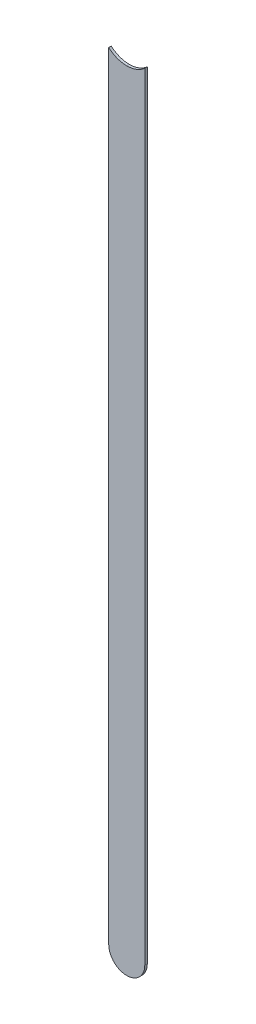
ISO-10303-21;
HEADER;
FILE_DESCRIPTION(('STEP AP214'),'2;1');
FILE_NAME('part.step','',(''),(''),'','','');
FILE_SCHEMA(('AUTOMOTIVE_DESIGN { 1 0 10303 214 1 1 1 1 }'));
ENDSEC;
DATA;
#1=APPLICATION_CONTEXT('core data for automotive mechanical design processes');
#2=APPLICATION_PROTOCOL_DEFINITION('international standard','automotive_design',2000,#1);
#3=PRODUCT_CONTEXT('',#1,'mechanical');
#4=PRODUCT('Part','Part','',(#3));
#5=PRODUCT_RELATED_PRODUCT_CATEGORY('part','',(#4));
#6=PRODUCT_DEFINITION_FORMATION('','',#4);
#7=PRODUCT_DEFINITION_CONTEXT('part definition',#1,'design');
#8=PRODUCT_DEFINITION('design','',#6,#7);
#9=PRODUCT_DEFINITION_SHAPE('','',#8);
#10=(LENGTH_UNIT() NAMED_UNIT(*) SI_UNIT(.MILLI.,.METRE.));
#11=(NAMED_UNIT(*) PLANE_ANGLE_UNIT() SI_UNIT($,.RADIAN.));
#12=(NAMED_UNIT(*) SI_UNIT($,.STERADIAN.) SOLID_ANGLE_UNIT());
#13=UNCERTAINTY_MEASURE_WITH_UNIT(LENGTH_MEASURE(1.E-05),#10,'distance_accuracy_value','');
#14=(GEOMETRIC_REPRESENTATION_CONTEXT(3) GLOBAL_UNCERTAINTY_ASSIGNED_CONTEXT((#13)) GLOBAL_UNIT_ASSIGNED_CONTEXT((#10,
#11,#12)) REPRESENTATION_CONTEXT('',''));
#15=CARTESIAN_POINT('',(0.,0.,0.));
#16=DIRECTION('',(0.,0.,1.));
#17=DIRECTION('',(1.,0.,0.));
#18=AXIS2_PLACEMENT_3D('',#15,#16,#17);
#19=CARTESIAN_POINT('',(173.478,-123.825,-0.035));
#20=DIRECTION('',(-1.,0.,0.));
#21=DIRECTION('',(0.,0.,1.));
#22=AXIS2_PLACEMENT_3D('',#19,#20,#21);
#23=PLANE('',#22);
#24=DIRECTION('',(0.,0.,-1.));
#25=VECTOR('',#24,1.);
#26=CARTESIAN_POINT('',(173.478,-113.0555084971,-0.045));
#27=LINE('',#26,#25);
#28=CARTESIAN_POINT('',(173.478,-113.0555084971,0.));
#29=VERTEX_POINT('',#28);
#30=CARTESIAN_POINT('',(173.478,-113.0555084971,-0.035));
#31=VERTEX_POINT('',#30);
#32=EDGE_CURVE('E11',#29,#31,#27,.T.);
#33=ORIENTED_EDGE('',*,*,#32,.F.);
#34=DIRECTION('',(0.,1.,0.));
#35=VECTOR('',#34,1.);
#36=CARTESIAN_POINT('',(173.478,-123.825,0.));
#37=LINE('',#36,#35);
#38=CARTESIAN_POINT('',(173.478,-123.825,0.));
#39=VERTEX_POINT('',#38);
#40=EDGE_CURVE('E74',#39,#29,#37,.T.);
#41=ORIENTED_EDGE('',*,*,#40,.F.);
#42=DIRECTION('',(0.,0.,1.));
#43=VECTOR('',#42,1.);
#44=CARTESIAN_POINT('',(173.478,-123.825,-0.035));
#45=LINE('',#44,#43);
#46=CARTESIAN_POINT('',(173.478,-123.825,-0.035));
#47=VERTEX_POINT('',#46);
#48=EDGE_CURVE('E68',#47,#39,#45,.T.);
#49=ORIENTED_EDGE('',*,*,#48,.F.);
#50=DIRECTION('',(0.,1.,0.));
#51=VECTOR('',#50,1.);
#52=CARTESIAN_POINT('',(173.478,-123.825,-0.035));
#53=LINE('',#52,#51);
#54=EDGE_CURVE('E71',#47,#31,#53,.T.);
#55=ORIENTED_EDGE('',*,*,#54,.T.);
#56=EDGE_LOOP('',(#33,#41,#49,#55));
#57=FACE_BOUND('',#56,.T.);
#58=ADVANCED_FACE('F17',(#57),#23,.F.);
#59=CARTESIAN_POINT('',(173.228,-112.776,-0.045));
#60=DIRECTION('',(0.,0.,-1.));
#61=DIRECTION('',(0.,-1.,0.));
#62=AXIS2_PLACEMENT_3D('',#59,#60,#61);
#63=CYLINDRICAL_SURFACE('',#62,0.375);
#64=CARTESIAN_POINT('',(173.228,-112.776,-0.035));
#65=DIRECTION('',(0.,0.,-1.));
#66=DIRECTION('',(0.,-1.,0.));
#67=AXIS2_PLACEMENT_3D('',#64,#65,#66);
#68=CIRCLE('',#67,0.375);
#69=CARTESIAN_POINT('',(173.228,-113.151,-0.035));
#70=VERTEX_POINT('',#69);
#71=EDGE_CURVE('E96',#31,#70,#68,.T.);
#72=ORIENTED_EDGE('',*,*,#71,.T.);
#73=DIRECTION('',(0.,0.,1.));
#74=VECTOR('',#73,1.);
#75=CARTESIAN_POINT('',(173.228,-113.151,-0.045));
#76=LINE('',#75,#74);
#77=CARTESIAN_POINT('',(173.228,-113.151,0.));
#78=VERTEX_POINT('',#77);
#79=EDGE_CURVE('E27',#70,#78,#76,.T.);
#80=ORIENTED_EDGE('',*,*,#79,.T.);
#81=CARTESIAN_POINT('',(173.228,-112.776,0.));
#82=DIRECTION('',(0.,0.,-1.));
#83=DIRECTION('',(0.,-1.,0.));
#84=AXIS2_PLACEMENT_3D('',#81,#82,#83);
#85=CIRCLE('',#84,0.375);
#86=EDGE_CURVE('E21',#29,#78,#85,.T.);
#87=ORIENTED_EDGE('',*,*,#86,.F.);
#88=ORIENTED_EDGE('',*,*,#32,.T.);
#89=EDGE_LOOP('',(#72,#80,#87,#88));
#90=FACE_BOUND('',#89,.T.);
#91=ADVANCED_FACE('F19',(#90),#63,.F.);
#92=CARTESIAN_POINT('',(173.228,-112.776,-0.045));
#93=DIRECTION('',(0.,0.,-1.));
#94=DIRECTION('',(0.,-1.,0.));
#95=AXIS2_PLACEMENT_3D('',#92,#93,#94);
#96=CYLINDRICAL_SURFACE('',#95,0.375);
#97=ORIENTED_EDGE('',*,*,#79,.F.);
#98=CARTESIAN_POINT('',(173.228,-112.776,-0.035));
#99=DIRECTION('',(0.,0.,-1.));
#100=DIRECTION('',(0.,-1.,0.));
#101=AXIS2_PLACEMENT_3D('',#98,#99,#100);
#102=CIRCLE('',#101,0.375);
#103=CARTESIAN_POINT('',(172.978,-113.0555084972,-0.035));
#104=VERTEX_POINT('',#103);
#105=EDGE_CURVE('E80',#70,#104,#102,.T.);
#106=ORIENTED_EDGE('',*,*,#105,.T.);
#107=DIRECTION('',(0.,0.,-1.));
#108=VECTOR('',#107,1.);
#109=CARTESIAN_POINT('',(172.978,-113.0555084971,-0.045));
#110=LINE('',#109,#108);
#111=CARTESIAN_POINT('',(172.978,-113.0555084972,0.));
#112=VERTEX_POINT('',#111);
#113=EDGE_CURVE('E128',#112,#104,#110,.T.);
#114=ORIENTED_EDGE('',*,*,#113,.F.);
#115=CARTESIAN_POINT('',(173.228,-112.776,0.));
#116=DIRECTION('',(0.,0.,-1.));
#117=DIRECTION('',(0.,-1.,0.));
#118=AXIS2_PLACEMENT_3D('',#115,#116,#117);
#119=CIRCLE('',#118,0.375);
#120=EDGE_CURVE('E110',#78,#112,#119,.T.);
#121=ORIENTED_EDGE('',*,*,#120,.F.);
#122=EDGE_LOOP('',(#97,#106,#114,#121));
#123=FACE_BOUND('',#122,.T.);
#124=ADVANCED_FACE('F161',(#123),#96,.F.);
#125=CARTESIAN_POINT('',(172.978,-112.776,0.));
#126=DIRECTION('',(0.,0.,1.));
#127=DIRECTION('',(1.,0.,0.));
#128=AXIS2_PLACEMENT_3D('',#125,#126,#127);
#129=PLANE('',#128);
#130=ORIENTED_EDGE('',*,*,#120,.T.);
#131=DIRECTION('',(0.,-1.,0.));
#132=VECTOR('',#131,1.);
#133=CARTESIAN_POINT('',(172.978,-112.776,0.));
#134=LINE('',#133,#132);
#135=CARTESIAN_POINT('',(172.978,-123.825,0.));
#136=VERTEX_POINT('',#135);
#137=EDGE_CURVE('E136',#112,#136,#134,.T.);
#138=ORIENTED_EDGE('',*,*,#137,.T.);
#139=CARTESIAN_POINT('',(173.228,-123.825,0.));
#140=DIRECTION('',(0.,0.,1.));
#141=DIRECTION('',(-1.,0.,0.));
#142=AXIS2_PLACEMENT_3D('',#139,#140,#141);
#143=CIRCLE('',#142,0.25);
#144=EDGE_CURVE('E79',#136,#39,#143,.T.);
#145=ORIENTED_EDGE('',*,*,#144,.T.);
#146=ORIENTED_EDGE('',*,*,#40,.T.);
#147=ORIENTED_EDGE('',*,*,#86,.T.);
#148=EDGE_LOOP('',(#130,#138,#145,#146,#147));
#149=FACE_BOUND('',#148,.T.);
#150=ADVANCED_FACE('F169',(#149),#129,.T.);
#151=CARTESIAN_POINT('',(173.228,-123.825,-0.035));
#152=DIRECTION('',(0.,0.,-1.));
#153=DIRECTION('',(-1.,0.,0.));
#154=AXIS2_PLACEMENT_3D('',#151,#152,#153);
#155=CYLINDRICAL_SURFACE('',#154,0.25);
#156=CARTESIAN_POINT('',(173.228,-123.825,-0.035));
#157=DIRECTION('',(0.,0.,1.));
#158=DIRECTION('',(-1.,0.,0.));
#159=AXIS2_PLACEMENT_3D('',#156,#157,#158);
#160=CIRCLE('',#159,0.25);
#161=CARTESIAN_POINT('',(172.978,-123.825,-0.035));
#162=VERTEX_POINT('',#161);
#163=EDGE_CURVE('E84',#162,#47,#160,.T.);
#164=ORIENTED_EDGE('',*,*,#163,.T.);
#165=ORIENTED_EDGE('',*,*,#48,.T.);
#166=ORIENTED_EDGE('',*,*,#144,.F.);
#167=DIRECTION('',(0.,0.,1.));
#168=VECTOR('',#167,1.);
#169=CARTESIAN_POINT('',(172.978,-123.825,-0.035));
#170=LINE('',#169,#168);
#171=EDGE_CURVE('E88',#162,#136,#170,.T.);
#172=ORIENTED_EDGE('',*,*,#171,.F.);
#173=EDGE_LOOP('',(#164,#165,#166,#172));
#174=FACE_BOUND('',#173,.T.);
#175=ADVANCED_FACE('F85',(#174),#155,.T.);
#176=CARTESIAN_POINT('',(172.978,-112.776,-0.035));
#177=DIRECTION('',(0.,0.,1.));
#178=DIRECTION('',(1.,0.,0.));
#179=AXIS2_PLACEMENT_3D('',#176,#177,#178);
#180=PLANE('',#179);
#181=ORIENTED_EDGE('',*,*,#71,.F.);
#182=ORIENTED_EDGE('',*,*,#54,.F.);
#183=ORIENTED_EDGE('',*,*,#163,.F.);
#184=DIRECTION('',(0.,-1.,0.));
#185=VECTOR('',#184,1.);
#186=CARTESIAN_POINT('',(172.978,-112.776,-0.035));
#187=LINE('',#186,#185);
#188=EDGE_CURVE('E103',#104,#162,#187,.T.);
#189=ORIENTED_EDGE('',*,*,#188,.F.);
#190=ORIENTED_EDGE('',*,*,#105,.F.);
#191=EDGE_LOOP('',(#181,#182,#183,#189,#190));
#192=FACE_BOUND('',#191,.T.);
#193=ADVANCED_FACE('F94',(#192),#180,.F.);
#194=CARTESIAN_POINT('',(172.978,-112.776,-0.035));
#195=DIRECTION('',(1.,0.,0.));
#196=DIRECTION('',(0.,1.,0.));
#197=AXIS2_PLACEMENT_3D('',#194,#195,#196);
#198=PLANE('',#197);
#199=ORIENTED_EDGE('',*,*,#171,.T.);
#200=ORIENTED_EDGE('',*,*,#137,.F.);
#201=ORIENTED_EDGE('',*,*,#113,.T.);
#202=ORIENTED_EDGE('',*,*,#188,.T.);
#203=EDGE_LOOP('',(#199,#200,#201,#202));
#204=FACE_BOUND('',#203,.T.);
#205=ADVANCED_FACE('F148',(#204),#198,.F.);
#206=CLOSED_SHELL('',(#58,#91,#124,#150,#175,#193,#205));
#207=MANIFOLD_SOLID_BREP('B1',#206);
#208=ADVANCED_BREP_SHAPE_REPRESENTATION('',(#18,#207),#14);
#209=SHAPE_DEFINITION_REPRESENTATION(#9,#208);
ENDSEC;
END-ISO-10303-21;
